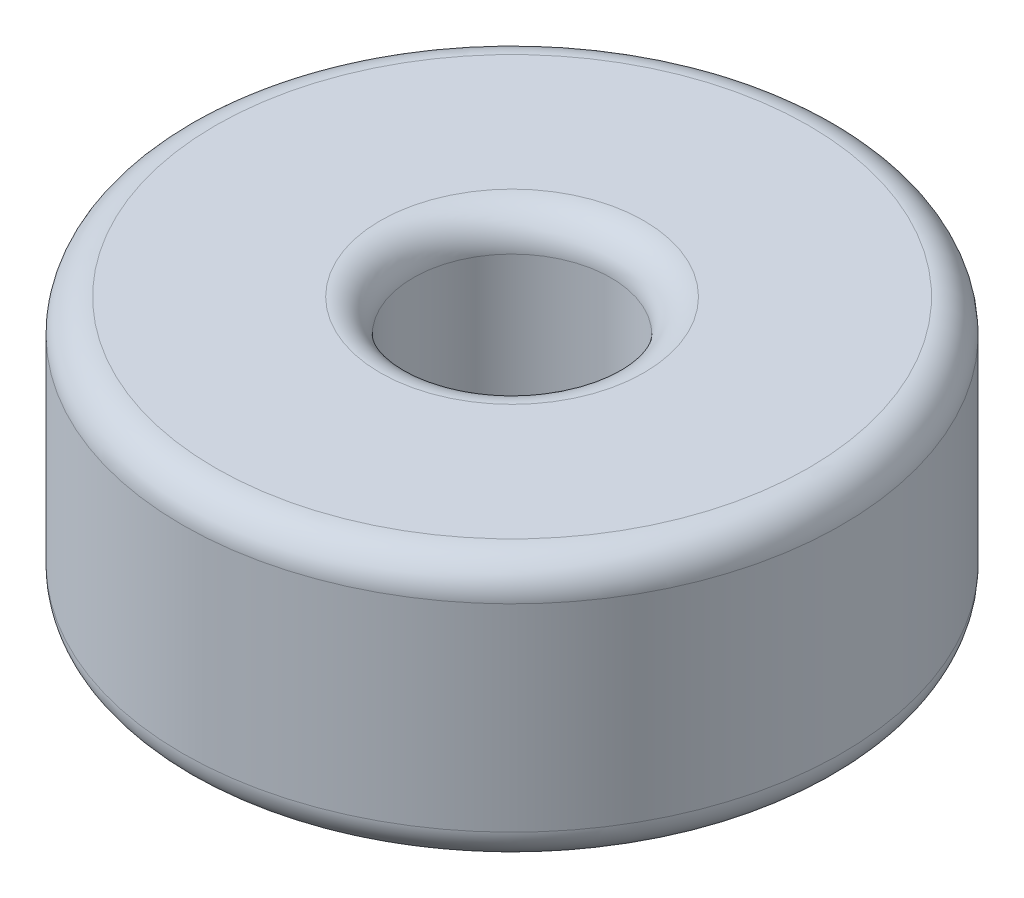
ISO-10303-21;
HEADER;
FILE_DESCRIPTION(('STEP AP214'),'2;1');
FILE_NAME('part.step','',(''),(''),'','','');
FILE_SCHEMA(('AUTOMOTIVE_DESIGN { 1 0 10303 214 1 1 1 1 }'));
ENDSEC;
DATA;
#1=APPLICATION_CONTEXT('core data for automotive mechanical design processes');
#2=APPLICATION_PROTOCOL_DEFINITION('international standard','automotive_design',2000,#1);
#3=PRODUCT_CONTEXT('',#1,'mechanical');
#4=PRODUCT('Part','Part','',(#3));
#5=PRODUCT_RELATED_PRODUCT_CATEGORY('part','',(#4));
#6=PRODUCT_DEFINITION_FORMATION('','',#4);
#7=PRODUCT_DEFINITION_CONTEXT('part definition',#1,'design');
#8=PRODUCT_DEFINITION('design','',#6,#7);
#9=PRODUCT_DEFINITION_SHAPE('','',#8);
#10=(LENGTH_UNIT() NAMED_UNIT(*) SI_UNIT(.MILLI.,.METRE.));
#11=(NAMED_UNIT(*) PLANE_ANGLE_UNIT() SI_UNIT($,.RADIAN.));
#12=(NAMED_UNIT(*) SI_UNIT($,.STERADIAN.) SOLID_ANGLE_UNIT());
#13=UNCERTAINTY_MEASURE_WITH_UNIT(LENGTH_MEASURE(1.E-05),#10,'distance_accuracy_value','');
#14=(GEOMETRIC_REPRESENTATION_CONTEXT(3) GLOBAL_UNCERTAINTY_ASSIGNED_CONTEXT((#13)) GLOBAL_UNIT_ASSIGNED_CONTEXT((#10,
#11,#12)) REPRESENTATION_CONTEXT('',''));
#15=CARTESIAN_POINT('',(0.,0.,0.));
#16=DIRECTION('',(0.,0.,1.));
#17=DIRECTION('',(1.,0.,0.));
#18=AXIS2_PLACEMENT_3D('',#15,#16,#17);
#19=CARTESIAN_POINT('',(0.,4.,0.));
#20=DIRECTION('',(0.,1.,0.));
#21=DIRECTION('',(0.,0.,1.));
#22=AXIS2_PLACEMENT_3D('',#19,#20,#21);
#23=PLANE('',#22);
#24=CARTESIAN_POINT('',(0.,4.,0.));
#25=DIRECTION('',(0.,1.,0.));
#26=DIRECTION('',(0.,0.,1.));
#27=AXIS2_PLACEMENT_3D('',#24,#25,#26);
#28=CIRCLE('',#27,2.);
#29=CARTESIAN_POINT('',(0.,4.,2.));
#30=VERTEX_POINT('',#29);
#31=EDGE_CURVE('E10',#30,#30,#28,.F.);
#32=ORIENTED_EDGE('',*,*,#31,.T.);
#33=EDGE_LOOP('',(#32));
#34=FACE_BOUND('',#33,.T.);
#35=CARTESIAN_POINT('',(0.,4.,0.));
#36=DIRECTION('',(0.,1.,0.));
#37=DIRECTION('',(0.,0.,1.));
#38=AXIS2_PLACEMENT_3D('',#35,#36,#37);
#39=CIRCLE('',#38,4.5);
#40=CARTESIAN_POINT('',(0.,4.,4.5));
#41=VERTEX_POINT('',#40);
#42=EDGE_CURVE('E60',#41,#41,#39,.T.);
#43=ORIENTED_EDGE('',*,*,#42,.T.);
#44=EDGE_LOOP('',(#43));
#45=FACE_BOUND('',#44,.T.);
#46=ADVANCED_FACE('F31',(#34,#45),#23,.T.);
#47=CARTESIAN_POINT('',(0.,0.,0.));
#48=DIRECTION('',(0.,1.,0.));
#49=DIRECTION('',(0.,0.,1.));
#50=AXIS2_PLACEMENT_3D('',#47,#48,#49);
#51=PLANE('',#50);
#52=CARTESIAN_POINT('',(0.,0.,0.));
#53=DIRECTION('',(0.,1.,0.));
#54=DIRECTION('',(0.,0.,1.));
#55=AXIS2_PLACEMENT_3D('',#52,#53,#54);
#56=CIRCLE('',#55,2.);
#57=CARTESIAN_POINT('',(0.,0.,2.));
#58=VERTEX_POINT('',#57);
#59=EDGE_CURVE('E46',#58,#58,#56,.T.);
#60=ORIENTED_EDGE('',*,*,#59,.T.);
#61=EDGE_LOOP('',(#60));
#62=FACE_BOUND('',#61,.T.);
#63=CARTESIAN_POINT('',(0.,0.,0.));
#64=DIRECTION('',(0.,1.,0.));
#65=DIRECTION('',(0.,0.,1.));
#66=AXIS2_PLACEMENT_3D('',#63,#64,#65);
#67=CIRCLE('',#66,4.5);
#68=CARTESIAN_POINT('',(0.,0.,4.5));
#69=VERTEX_POINT('',#68);
#70=EDGE_CURVE('E51',#69,#69,#67,.F.);
#71=ORIENTED_EDGE('',*,*,#70,.T.);
#72=EDGE_LOOP('',(#71));
#73=FACE_BOUND('',#72,.T.);
#74=ADVANCED_FACE('F83',(#62,#73),#51,.F.);
#75=CARTESIAN_POINT('',(0.,4.,0.));
#76=DIRECTION('',(0.,-1.,0.));
#77=DIRECTION('',(0.,0.,-1.));
#78=AXIS2_PLACEMENT_3D('',#75,#76,#77);
#79=CYLINDRICAL_SURFACE('',#78,5.);
#80=CARTESIAN_POINT('',(0.,3.5,0.));
#81=DIRECTION('',(0.,1.,0.));
#82=DIRECTION('',(0.,0.,1.));
#83=AXIS2_PLACEMENT_3D('',#80,#81,#82);
#84=CIRCLE('',#83,5.);
#85=CARTESIAN_POINT('',(0.,3.5,5.));
#86=VERTEX_POINT('',#85);
#87=EDGE_CURVE('E54',#86,#86,#84,.F.);
#88=ORIENTED_EDGE('',*,*,#87,.T.);
#89=EDGE_LOOP('',(#88));
#90=FACE_BOUND('',#89,.T.);
#91=CARTESIAN_POINT('',(0.,0.5,0.));
#92=DIRECTION('',(0.,1.,0.));
#93=DIRECTION('',(0.,0.,1.));
#94=AXIS2_PLACEMENT_3D('',#91,#92,#93);
#95=CIRCLE('',#94,5.);
#96=CARTESIAN_POINT('',(0.,0.5,5.));
#97=VERTEX_POINT('',#96);
#98=EDGE_CURVE('E57',#97,#97,#95,.T.);
#99=ORIENTED_EDGE('',*,*,#98,.T.);
#100=EDGE_LOOP('',(#99));
#101=FACE_BOUND('',#100,.T.);
#102=ADVANCED_FACE('F78',(#90,#101),#79,.T.);
#103=CARTESIAN_POINT('',(0.,4.,0.));
#104=DIRECTION('',(0.,-1.,0.));
#105=DIRECTION('',(0.,0.,-1.));
#106=AXIS2_PLACEMENT_3D('',#103,#104,#105);
#107=CYLINDRICAL_SURFACE('',#106,1.5);
#108=CARTESIAN_POINT('',(0.,0.5,0.));
#109=DIRECTION('',(0.,1.,0.));
#110=DIRECTION('',(0.,0.,1.));
#111=AXIS2_PLACEMENT_3D('',#108,#109,#110);
#112=CIRCLE('',#111,1.5);
#113=CARTESIAN_POINT('',(0.,0.5,1.5));
#114=VERTEX_POINT('',#113);
#115=EDGE_CURVE('E38',#114,#114,#112,.F.);
#116=ORIENTED_EDGE('',*,*,#115,.T.);
#117=EDGE_LOOP('',(#116));
#118=FACE_BOUND('',#117,.T.);
#119=CARTESIAN_POINT('',(0.,3.5,0.));
#120=DIRECTION('',(0.,1.,0.));
#121=DIRECTION('',(0.,0.,1.));
#122=AXIS2_PLACEMENT_3D('',#119,#120,#121);
#123=CIRCLE('',#122,1.5);
#124=CARTESIAN_POINT('',(0.,3.5,1.5));
#125=VERTEX_POINT('',#124);
#126=EDGE_CURVE('E42',#125,#125,#123,.T.);
#127=ORIENTED_EDGE('',*,*,#126,.T.);
#128=EDGE_LOOP('',(#127));
#129=FACE_BOUND('',#128,.T.);
#130=ADVANCED_FACE('F68',(#118,#129),#107,.F.);
#131=CARTESIAN_POINT('',(0.,3.5,0.));
#132=DIRECTION('',(0.,1.,0.));
#133=DIRECTION('',(0.,0.,1.));
#134=AXIS2_PLACEMENT_3D('',#131,#132,#133);
#135=TOROIDAL_SURFACE('',#134,4.5,0.5);
#136=ORIENTED_EDGE('',*,*,#87,.F.);
#137=EDGE_LOOP('',(#136));
#138=FACE_BOUND('',#137,.T.);
#139=ORIENTED_EDGE('',*,*,#42,.F.);
#140=EDGE_LOOP('',(#139));
#141=FACE_BOUND('',#140,.T.);
#142=ADVANCED_FACE('F65',(#138,#141),#135,.T.);
#143=CARTESIAN_POINT('',(0.,0.5,0.));
#144=DIRECTION('',(0.,1.,0.));
#145=DIRECTION('',(0.,0.,1.));
#146=AXIS2_PLACEMENT_3D('',#143,#144,#145);
#147=TOROIDAL_SURFACE('',#146,4.5,0.5);
#148=ORIENTED_EDGE('',*,*,#70,.F.);
#149=EDGE_LOOP('',(#148));
#150=FACE_BOUND('',#149,.T.);
#151=ORIENTED_EDGE('',*,*,#98,.F.);
#152=EDGE_LOOP('',(#151));
#153=FACE_BOUND('',#152,.T.);
#154=ADVANCED_FACE('F67',(#150,#153),#147,.T.);
#155=CARTESIAN_POINT('',(0.,0.5,0.));
#156=DIRECTION('',(0.,1.,0.));
#157=DIRECTION('',(0.,0.,1.));
#158=AXIS2_PLACEMENT_3D('',#155,#156,#157);
#159=TOROIDAL_SURFACE('',#158,2.,0.5);
#160=ORIENTED_EDGE('',*,*,#115,.F.);
#161=EDGE_LOOP('',(#160));
#162=FACE_BOUND('',#161,.T.);
#163=ORIENTED_EDGE('',*,*,#59,.F.);
#164=EDGE_LOOP('',(#163));
#165=FACE_BOUND('',#164,.T.);
#166=ADVANCED_FACE('F75',(#162,#165),#159,.T.);
#167=CARTESIAN_POINT('',(0.,3.5,0.));
#168=DIRECTION('',(0.,1.,0.));
#169=DIRECTION('',(0.,0.,1.));
#170=AXIS2_PLACEMENT_3D('',#167,#168,#169);
#171=TOROIDAL_SURFACE('',#170,2.,0.5);
#172=ORIENTED_EDGE('',*,*,#31,.F.);
#173=EDGE_LOOP('',(#172));
#174=FACE_BOUND('',#173,.T.);
#175=ORIENTED_EDGE('',*,*,#126,.F.);
#176=EDGE_LOOP('',(#175));
#177=FACE_BOUND('',#176,.T.);
#178=ADVANCED_FACE('F33',(#174,#177),#171,.T.);
#179=CLOSED_SHELL('',(#46,#74,#102,#130,#142,#154,#166,#178));
#180=MANIFOLD_SOLID_BREP('B2',#179);
#181=ADVANCED_BREP_SHAPE_REPRESENTATION('',(#18,#180),#14);
#182=SHAPE_DEFINITION_REPRESENTATION(#9,#181);
ENDSEC;
END-ISO-10303-21;
